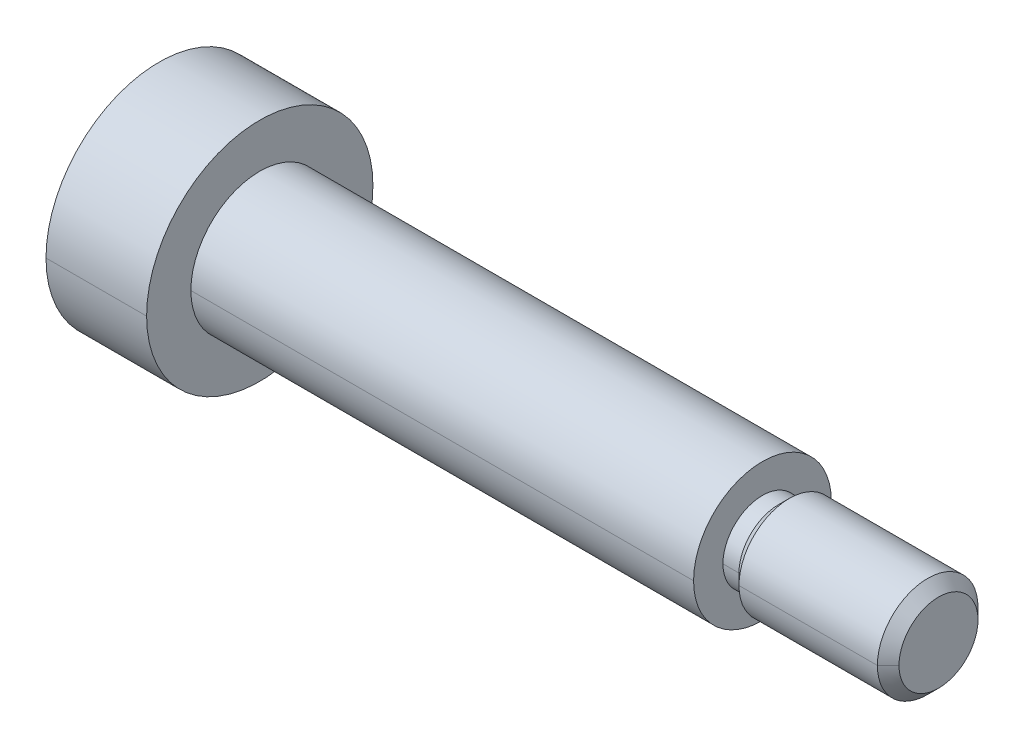
ISO-10303-21;
HEADER;
FILE_DESCRIPTION(('STEP AP214'),'2;1');
FILE_NAME('part.step','',(''),(''),'','','');
FILE_SCHEMA(('AUTOMOTIVE_DESIGN { 1 0 10303 214 1 1 1 1 }'));
ENDSEC;
DATA;
#1=APPLICATION_CONTEXT('core data for automotive mechanical design processes');
#2=APPLICATION_PROTOCOL_DEFINITION('international standard','automotive_design',2000,#1);
#3=PRODUCT_CONTEXT('',#1,'mechanical');
#4=PRODUCT('Part','Part','',(#3));
#5=PRODUCT_RELATED_PRODUCT_CATEGORY('part','',(#4));
#6=PRODUCT_DEFINITION_FORMATION('','',#4);
#7=PRODUCT_DEFINITION_CONTEXT('part definition',#1,'design');
#8=PRODUCT_DEFINITION('design','',#6,#7);
#9=PRODUCT_DEFINITION_SHAPE('','',#8);
#10=(LENGTH_UNIT() NAMED_UNIT(*) SI_UNIT(.MILLI.,.METRE.));
#11=(NAMED_UNIT(*) PLANE_ANGLE_UNIT() SI_UNIT($,.RADIAN.));
#12=(NAMED_UNIT(*) SI_UNIT($,.STERADIAN.) SOLID_ANGLE_UNIT());
#13=UNCERTAINTY_MEASURE_WITH_UNIT(LENGTH_MEASURE(1.E-05),#10,'distance_accuracy_value','');
#14=(GEOMETRIC_REPRESENTATION_CONTEXT(3) GLOBAL_UNCERTAINTY_ASSIGNED_CONTEXT((#13)) GLOBAL_UNIT_ASSIGNED_CONTEXT((#10,
#11,#12)) REPRESENTATION_CONTEXT('',''));
#15=CARTESIAN_POINT('',(0.,0.,0.));
#16=DIRECTION('',(0.,0.,1.));
#17=DIRECTION('',(1.,0.,0.));
#18=AXIS2_PLACEMENT_3D('',#15,#16,#17);
#19=CARTESIAN_POINT('',(26.99,0.,0.));
#20=DIRECTION('',(-1.,0.,0.));
#21=DIRECTION('',(0.,-1.,0.));
#22=AXIS2_PLACEMENT_3D('',#19,#20,#21);
#23=CYLINDRICAL_SURFACE('',#22,4.4996);
#24=CARTESIAN_POINT('',(0.,0.,0.));
#25=DIRECTION('',(1.,0.,0.));
#26=DIRECTION('',(0.,0.,-1.));
#27=AXIS2_PLACEMENT_3D('',#24,#25,#26);
#28=CIRCLE('',#27,4.4996);
#29=CARTESIAN_POINT('',(0.,0.,-4.4996));
#30=VERTEX_POINT('',#29);
#31=CARTESIAN_POINT('',(0.,0.,4.4996));
#32=VERTEX_POINT('',#31);
#33=EDGE_CURVE('E11',#30,#32,#28,.T.);
#34=ORIENTED_EDGE('',*,*,#33,.F.);
#35=DIRECTION('',(-1.,0.,0.));
#36=VECTOR('',#35,1.);
#37=CARTESIAN_POINT('',(0.,0.,-4.4996));
#38=LINE('',#37,#36);
#39=CARTESIAN_POINT('',(-4.0005,0.,-4.4996));
#40=VERTEX_POINT('',#39);
#41=EDGE_CURVE('E25',#30,#40,#38,.T.);
#42=ORIENTED_EDGE('',*,*,#41,.T.);
#43=CARTESIAN_POINT('',(-4.0005,0.,0.));
#44=DIRECTION('',(1.,0.,0.));
#45=DIRECTION('',(0.,0.,-1.));
#46=AXIS2_PLACEMENT_3D('',#43,#44,#45);
#47=CIRCLE('',#46,4.4996);
#48=CARTESIAN_POINT('',(-4.0005,0.,4.4996));
#49=VERTEX_POINT('',#48);
#50=EDGE_CURVE('E342',#40,#49,#47,.T.);
#51=ORIENTED_EDGE('',*,*,#50,.T.);
#52=DIRECTION('',(-1.,0.,0.));
#53=VECTOR('',#52,1.);
#54=CARTESIAN_POINT('',(0.,0.,4.4996));
#55=LINE('',#54,#53);
#56=EDGE_CURVE('E337',#32,#49,#55,.T.);
#57=ORIENTED_EDGE('',*,*,#56,.F.);
#58=EDGE_LOOP('',(#34,#42,#51,#57));
#59=FACE_BOUND('',#58,.T.);
#60=ADVANCED_FACE('F17',(#59),#23,.T.);
#61=CARTESIAN_POINT('',(26.99,0.,0.));
#62=DIRECTION('',(-1.,0.,0.));
#63=DIRECTION('',(0.,1.,0.));
#64=AXIS2_PLACEMENT_3D('',#61,#62,#63);
#65=CYLINDRICAL_SURFACE('',#64,4.4996);
#66=CARTESIAN_POINT('',(-4.0005,0.,0.));
#67=DIRECTION('',(1.,0.,0.));
#68=DIRECTION('',(0.,0.,-1.));
#69=AXIS2_PLACEMENT_3D('',#66,#67,#68);
#70=CIRCLE('',#69,4.4996);
#71=EDGE_CURVE('E333',#49,#40,#70,.T.);
#72=ORIENTED_EDGE('',*,*,#71,.T.);
#73=ORIENTED_EDGE('',*,*,#41,.F.);
#74=CARTESIAN_POINT('',(0.,0.,0.));
#75=DIRECTION('',(1.,0.,0.));
#76=DIRECTION('',(0.,0.,-1.));
#77=AXIS2_PLACEMENT_3D('',#74,#75,#76);
#78=CIRCLE('',#77,4.4996);
#79=EDGE_CURVE('E328',#32,#30,#78,.T.);
#80=ORIENTED_EDGE('',*,*,#79,.F.);
#81=ORIENTED_EDGE('',*,*,#56,.T.);
#82=EDGE_LOOP('',(#72,#73,#80,#81));
#83=FACE_BOUND('',#82,.T.);
#84=ADVANCED_FACE('F355',(#83),#65,.T.);
#85=CARTESIAN_POINT('',(0.,4.4996,0.));
#86=DIRECTION('',(-1.,0.,0.));
#87=DIRECTION('',(0.,0.,1.));
#88=AXIS2_PLACEMENT_3D('',#85,#86,#87);
#89=PLANE('',#88);
#90=CARTESIAN_POINT('',(0.,0.,0.));
#91=DIRECTION('',(1.,0.,0.));
#92=DIRECTION('',(0.,0.,-1.));
#93=AXIS2_PLACEMENT_3D('',#90,#91,#92);
#94=CIRCLE('',#93,2.7394);
#95=CARTESIAN_POINT('',(0.,0.,-2.7394));
#96=VERTEX_POINT('',#95);
#97=CARTESIAN_POINT('',(0.,0.,2.7394));
#98=VERTEX_POINT('',#97);
#99=EDGE_CURVE('E323',#96,#98,#94,.T.);
#100=ORIENTED_EDGE('',*,*,#99,.F.);
#101=CARTESIAN_POINT('',(0.,0.,0.));
#102=DIRECTION('',(1.,0.,0.));
#103=DIRECTION('',(0.,0.,-1.));
#104=AXIS2_PLACEMENT_3D('',#101,#102,#103);
#105=CIRCLE('',#104,2.7394);
#106=EDGE_CURVE('E318',#98,#96,#105,.T.);
#107=ORIENTED_EDGE('',*,*,#106,.F.);
#108=EDGE_LOOP('',(#100,#107));
#109=FACE_BOUND('',#108,.T.);
#110=ORIENTED_EDGE('',*,*,#33,.T.);
#111=ORIENTED_EDGE('',*,*,#79,.T.);
#112=EDGE_LOOP('',(#110,#111));
#113=FACE_BOUND('',#112,.T.);
#114=ADVANCED_FACE('F388',(#109,#113),#89,.F.);
#115=CARTESIAN_POINT('',(26.99,0.,0.));
#116=DIRECTION('',(-1.,0.,0.));
#117=DIRECTION('',(0.,1.,0.));
#118=AXIS2_PLACEMENT_3D('',#115,#116,#117);
#119=CYLINDRICAL_SURFACE('',#118,2.7394);
#120=ORIENTED_EDGE('',*,*,#106,.T.);
#121=DIRECTION('',(-1.,0.,0.));
#122=VECTOR('',#121,1.);
#123=CARTESIAN_POINT('',(19.9898,0.,-2.7394));
#124=LINE('',#123,#122);
#125=CARTESIAN_POINT('',(19.9898,0.,-2.7394));
#126=VERTEX_POINT('',#125);
#127=EDGE_CURVE('E313',#126,#96,#124,.T.);
#128=ORIENTED_EDGE('',*,*,#127,.F.);
#129=CARTESIAN_POINT('',(19.9898,0.,0.));
#130=DIRECTION('',(1.,0.,0.));
#131=DIRECTION('',(0.,0.,-1.));
#132=AXIS2_PLACEMENT_3D('',#129,#130,#131);
#133=CIRCLE('',#132,2.7394);
#134=CARTESIAN_POINT('',(19.9898,0.,2.7394));
#135=VERTEX_POINT('',#134);
#136=EDGE_CURVE('E308',#135,#126,#133,.T.);
#137=ORIENTED_EDGE('',*,*,#136,.F.);
#138=DIRECTION('',(-1.,0.,0.));
#139=VECTOR('',#138,1.);
#140=CARTESIAN_POINT('',(19.9898,0.,2.7394));
#141=LINE('',#140,#139);
#142=EDGE_CURVE('E303',#135,#98,#141,.T.);
#143=ORIENTED_EDGE('',*,*,#142,.T.);
#144=EDGE_LOOP('',(#120,#128,#137,#143));
#145=FACE_BOUND('',#144,.T.);
#146=ADVANCED_FACE('F392',(#145),#119,.T.);
#147=CARTESIAN_POINT('',(26.99,0.,0.));
#148=DIRECTION('',(-1.,0.,0.));
#149=DIRECTION('',(0.,-1.,0.));
#150=AXIS2_PLACEMENT_3D('',#147,#148,#149);
#151=CYLINDRICAL_SURFACE('',#150,2.7394);
#152=CARTESIAN_POINT('',(19.9898,0.,0.));
#153=DIRECTION('',(1.,0.,0.));
#154=DIRECTION('',(0.,0.,-1.));
#155=AXIS2_PLACEMENT_3D('',#152,#153,#154);
#156=CIRCLE('',#155,2.7394);
#157=EDGE_CURVE('E298',#126,#135,#156,.T.);
#158=ORIENTED_EDGE('',*,*,#157,.F.);
#159=ORIENTED_EDGE('',*,*,#127,.T.);
#160=ORIENTED_EDGE('',*,*,#99,.T.);
#161=ORIENTED_EDGE('',*,*,#142,.F.);
#162=EDGE_LOOP('',(#158,#159,#160,#161));
#163=FACE_BOUND('',#162,.T.);
#164=ADVANCED_FACE('F398',(#163),#151,.T.);
#165=CARTESIAN_POINT('',(19.9898,2.7394,0.));
#166=DIRECTION('',(-1.,0.,0.));
#167=DIRECTION('',(0.,0.,1.));
#168=AXIS2_PLACEMENT_3D('',#165,#166,#167);
#169=PLANE('',#168);
#170=CARTESIAN_POINT('',(19.9898,0.,0.));
#171=DIRECTION('',(1.,0.,0.));
#172=DIRECTION('',(0.,0.,-1.));
#173=AXIS2_PLACEMENT_3D('',#170,#171,#172);
#174=CIRCLE('',#173,1.571);
#175=CARTESIAN_POINT('',(19.9898,0.,-1.571));
#176=VERTEX_POINT('',#175);
#177=CARTESIAN_POINT('',(19.9898,0.,1.571));
#178=VERTEX_POINT('',#177);
#179=EDGE_CURVE('E293',#176,#178,#174,.T.);
#180=ORIENTED_EDGE('',*,*,#179,.F.);
#181=CARTESIAN_POINT('',(19.9898,0.,0.));
#182=DIRECTION('',(1.,0.,0.));
#183=DIRECTION('',(0.,0.,-1.));
#184=AXIS2_PLACEMENT_3D('',#181,#182,#183);
#185=CIRCLE('',#184,1.571);
#186=EDGE_CURVE('E288',#178,#176,#185,.T.);
#187=ORIENTED_EDGE('',*,*,#186,.F.);
#188=EDGE_LOOP('',(#180,#187));
#189=FACE_BOUND('',#188,.T.);
#190=ORIENTED_EDGE('',*,*,#157,.T.);
#191=ORIENTED_EDGE('',*,*,#136,.T.);
#192=EDGE_LOOP('',(#190,#191));
#193=FACE_BOUND('',#192,.T.);
#194=ADVANCED_FACE('F402',(#189,#193),#169,.F.);
#195=CARTESIAN_POINT('',(26.99,0.,0.));
#196=DIRECTION('',(-1.,0.,0.));
#197=DIRECTION('',(0.,1.,0.));
#198=AXIS2_PLACEMENT_3D('',#195,#196,#197);
#199=CYLINDRICAL_SURFACE('',#198,1.571);
#200=ORIENTED_EDGE('',*,*,#186,.T.);
#201=DIRECTION('',(-1.,0.,0.));
#202=VECTOR('',#201,1.);
#203=CARTESIAN_POINT('',(20.626681811818,0.,-1.571));
#204=LINE('',#203,#202);
#205=CARTESIAN_POINT('',(20.626681811818,0.,-1.571));
#206=VERTEX_POINT('',#205);
#207=EDGE_CURVE('E283',#206,#176,#204,.T.);
#208=ORIENTED_EDGE('',*,*,#207,.F.);
#209=CARTESIAN_POINT('',(20.626681811818,0.,0.));
#210=DIRECTION('',(1.,0.,0.));
#211=DIRECTION('',(0.,0.,-1.));
#212=AXIS2_PLACEMENT_3D('',#209,#210,#211);
#213=CIRCLE('',#212,1.571);
#214=CARTESIAN_POINT('',(20.626681811818,0.,1.571));
#215=VERTEX_POINT('',#214);
#216=EDGE_CURVE('E278',#215,#206,#213,.T.);
#217=ORIENTED_EDGE('',*,*,#216,.F.);
#218=DIRECTION('',(-1.,0.,0.));
#219=VECTOR('',#218,1.);
#220=CARTESIAN_POINT('',(20.626681811818,0.,1.571));
#221=LINE('',#220,#219);
#222=EDGE_CURVE('E273',#215,#178,#221,.T.);
#223=ORIENTED_EDGE('',*,*,#222,.T.);
#224=EDGE_LOOP('',(#200,#208,#217,#223));
#225=FACE_BOUND('',#224,.T.);
#226=ADVANCED_FACE('F406',(#225),#199,.T.);
#227=CARTESIAN_POINT('',(26.99,0.,0.));
#228=DIRECTION('',(-1.,0.,0.));
#229=DIRECTION('',(0.,-1.,0.));
#230=AXIS2_PLACEMENT_3D('',#227,#228,#229);
#231=CYLINDRICAL_SURFACE('',#230,1.571);
#232=CARTESIAN_POINT('',(20.626681811818,0.,0.));
#233=DIRECTION('',(1.,0.,0.));
#234=DIRECTION('',(0.,0.,-1.));
#235=AXIS2_PLACEMENT_3D('',#232,#233,#234);
#236=CIRCLE('',#235,1.571);
#237=EDGE_CURVE('E268',#206,#215,#236,.T.);
#238=ORIENTED_EDGE('',*,*,#237,.F.);
#239=ORIENTED_EDGE('',*,*,#207,.T.);
#240=ORIENTED_EDGE('',*,*,#179,.T.);
#241=ORIENTED_EDGE('',*,*,#222,.F.);
#242=EDGE_LOOP('',(#238,#239,#240,#241));
#243=FACE_BOUND('',#242,.T.);
#244=ADVANCED_FACE('F410',(#243),#231,.T.);
#245=CARTESIAN_POINT('',(20.626681811818,0.,0.));
#246=DIRECTION('',(1.,0.,0.));
#247=DIRECTION('',(0.,-1.,0.));
#248=AXIS2_PLACEMENT_3D('',#245,#246,#247);
#249=CONICAL_SURFACE('',#248,1.571,0.7853981634);
#250=CARTESIAN_POINT('',(21.055931811818,0.,0.));
#251=DIRECTION('',(1.,0.,0.));
#252=DIRECTION('',(0.,0.,-1.));
#253=AXIS2_PLACEMENT_3D('',#250,#251,#252);
#254=CIRCLE('',#253,2.00025);
#255=CARTESIAN_POINT('',(21.055931811818,0.,-2.00025));
#256=VERTEX_POINT('',#255);
#257=CARTESIAN_POINT('',(21.055931811818,0.,2.00025));
#258=VERTEX_POINT('',#257);
#259=EDGE_CURVE('E263',#256,#258,#254,.T.);
#260=ORIENTED_EDGE('',*,*,#259,.F.);
#261=DIRECTION('',(0.707106781184747,0.,-0.707106781188348));
#262=VECTOR('',#261,1.);
#263=CARTESIAN_POINT('',(20.626681811818,0.,-1.571));
#264=LINE('',#263,#262);
#265=EDGE_CURVE('E258',#206,#256,#264,.T.);
#266=ORIENTED_EDGE('',*,*,#265,.F.);
#267=ORIENTED_EDGE('',*,*,#237,.T.);
#268=DIRECTION('',(0.707106781184747,0.,0.707106781188348));
#269=VECTOR('',#268,1.);
#270=CARTESIAN_POINT('',(20.626681811818,0.,1.571));
#271=LINE('',#270,#269);
#272=EDGE_CURVE('E254',#215,#258,#271,.T.);
#273=ORIENTED_EDGE('',*,*,#272,.T.);
#274=EDGE_LOOP('',(#260,#266,#267,#273));
#275=FACE_BOUND('',#274,.T.);
#276=ADVANCED_FACE('F414',(#275),#249,.T.);
#277=CARTESIAN_POINT('',(20.626681811818,0.,0.));
#278=DIRECTION('',(1.,0.,0.));
#279=DIRECTION('',(0.,1.,0.));
#280=AXIS2_PLACEMENT_3D('',#277,#278,#279);
#281=CONICAL_SURFACE('',#280,1.571,0.7853981634);
#282=ORIENTED_EDGE('',*,*,#216,.T.);
#283=ORIENTED_EDGE('',*,*,#265,.T.);
#284=CARTESIAN_POINT('',(21.055931811818,0.,0.));
#285=DIRECTION('',(1.,0.,0.));
#286=DIRECTION('',(0.,0.,-1.));
#287=AXIS2_PLACEMENT_3D('',#284,#285,#286);
#288=CIRCLE('',#287,2.00025);
#289=EDGE_CURVE('E249',#258,#256,#288,.T.);
#290=ORIENTED_EDGE('',*,*,#289,.F.);
#291=ORIENTED_EDGE('',*,*,#272,.F.);
#292=EDGE_LOOP('',(#282,#283,#290,#291));
#293=FACE_BOUND('',#292,.T.);
#294=ADVANCED_FACE('F418',(#293),#281,.T.);
#295=CARTESIAN_POINT('',(26.99,0.,0.));
#296=DIRECTION('',(-1.,0.,0.));
#297=DIRECTION('',(0.,1.,0.));
#298=AXIS2_PLACEMENT_3D('',#295,#296,#297);
#299=CYLINDRICAL_SURFACE('',#298,2.00025);
#300=ORIENTED_EDGE('',*,*,#289,.T.);
#301=DIRECTION('',(-1.,0.,0.));
#302=VECTOR('',#301,1.);
#303=CARTESIAN_POINT('',(26.56025,0.,-2.00025));
#304=LINE('',#303,#302);
#305=CARTESIAN_POINT('',(26.56025,0.,-2.00025));
#306=VERTEX_POINT('',#305);
#307=EDGE_CURVE('E244',#306,#256,#304,.T.);
#308=ORIENTED_EDGE('',*,*,#307,.F.);
#309=CARTESIAN_POINT('',(26.56025,0.,0.));
#310=DIRECTION('',(1.,0.,0.));
#311=DIRECTION('',(0.,0.,-1.));
#312=AXIS2_PLACEMENT_3D('',#309,#310,#311);
#313=CIRCLE('',#312,2.00025);
#314=CARTESIAN_POINT('',(26.56025,0.,2.00025));
#315=VERTEX_POINT('',#314);
#316=EDGE_CURVE('E239',#315,#306,#313,.T.);
#317=ORIENTED_EDGE('',*,*,#316,.F.);
#318=DIRECTION('',(-1.,0.,0.));
#319=VECTOR('',#318,1.);
#320=CARTESIAN_POINT('',(26.56025,0.,2.00025));
#321=LINE('',#320,#319);
#322=EDGE_CURVE('E234',#315,#258,#321,.T.);
#323=ORIENTED_EDGE('',*,*,#322,.T.);
#324=EDGE_LOOP('',(#300,#308,#317,#323));
#325=FACE_BOUND('',#324,.T.);
#326=ADVANCED_FACE('F422',(#325),#299,.T.);
#327=CARTESIAN_POINT('',(26.99,0.,0.));
#328=DIRECTION('',(-1.,0.,0.));
#329=DIRECTION('',(0.,-1.,0.));
#330=AXIS2_PLACEMENT_3D('',#327,#328,#329);
#331=CYLINDRICAL_SURFACE('',#330,2.00025);
#332=CARTESIAN_POINT('',(26.56025,0.,0.));
#333=DIRECTION('',(1.,0.,0.));
#334=DIRECTION('',(0.,0.,-1.));
#335=AXIS2_PLACEMENT_3D('',#332,#333,#334);
#336=CIRCLE('',#335,2.00025);
#337=EDGE_CURVE('E229',#306,#315,#336,.T.);
#338=ORIENTED_EDGE('',*,*,#337,.F.);
#339=ORIENTED_EDGE('',*,*,#307,.T.);
#340=ORIENTED_EDGE('',*,*,#259,.T.);
#341=ORIENTED_EDGE('',*,*,#322,.F.);
#342=EDGE_LOOP('',(#338,#339,#340,#341));
#343=FACE_BOUND('',#342,.T.);
#344=ADVANCED_FACE('F426',(#343),#331,.T.);
#345=CARTESIAN_POINT('',(26.56025,0.,0.));
#346=DIRECTION('',(-1.,0.,0.));
#347=DIRECTION('',(0.,-1.,0.));
#348=AXIS2_PLACEMENT_3D('',#345,#346,#347);
#349=CONICAL_SURFACE('',#348,2.00025,0.7853981634);
#350=CARTESIAN_POINT('',(26.99,0.,0.));
#351=DIRECTION('',(1.,0.,0.));
#352=DIRECTION('',(0.,0.,-1.));
#353=AXIS2_PLACEMENT_3D('',#350,#351,#352);
#354=CIRCLE('',#353,1.5705);
#355=CARTESIAN_POINT('',(26.99,0.,-1.5705));
#356=VERTEX_POINT('',#355);
#357=CARTESIAN_POINT('',(26.9899999999989,0.,1.5704999999989));
#358=VERTEX_POINT('',#357);
#359=EDGE_CURVE('E224',#356,#358,#354,.T.);
#360=ORIENTED_EDGE('',*,*,#359,.F.);
#361=DIRECTION('',(-0.707106781184745,0.,-0.707106781188351));
#362=VECTOR('',#361,1.);
#363=CARTESIAN_POINT('',(26.9899999999989,0.,-1.5704999999989));
#364=LINE('',#363,#362);
#365=EDGE_CURVE('E219',#356,#306,#364,.T.);
#366=ORIENTED_EDGE('',*,*,#365,.T.);
#367=ORIENTED_EDGE('',*,*,#337,.T.);
#368=DIRECTION('',(-0.707106781184745,0.,0.707106781188351));
#369=VECTOR('',#368,1.);
#370=CARTESIAN_POINT('',(26.9899999999989,0.,1.5704999999989));
#371=LINE('',#370,#369);
#372=EDGE_CURVE('E214',#358,#315,#371,.T.);
#373=ORIENTED_EDGE('',*,*,#372,.F.);
#374=EDGE_LOOP('',(#360,#366,#367,#373));
#375=FACE_BOUND('',#374,.T.);
#376=ADVANCED_FACE('F430',(#375),#349,.T.);
#377=CARTESIAN_POINT('',(26.56025,0.,0.));
#378=DIRECTION('',(-1.,0.,0.));
#379=DIRECTION('',(0.,1.,0.));
#380=AXIS2_PLACEMENT_3D('',#377,#378,#379);
#381=CONICAL_SURFACE('',#380,2.00025,0.7853981634);
#382=ORIENTED_EDGE('',*,*,#316,.T.);
#383=ORIENTED_EDGE('',*,*,#365,.F.);
#384=CARTESIAN_POINT('',(26.99,0.,0.));
#385=DIRECTION('',(1.,0.,0.));
#386=DIRECTION('',(0.,0.,-1.));
#387=AXIS2_PLACEMENT_3D('',#384,#385,#386);
#388=CIRCLE('',#387,1.5705);
#389=EDGE_CURVE('E209',#358,#356,#388,.T.);
#390=ORIENTED_EDGE('',*,*,#389,.F.);
#391=ORIENTED_EDGE('',*,*,#372,.T.);
#392=EDGE_LOOP('',(#382,#383,#390,#391));
#393=FACE_BOUND('',#392,.T.);
#394=ADVANCED_FACE('F434',(#393),#381,.T.);
#395=CARTESIAN_POINT('',(26.99,1.5705,0.));
#396=DIRECTION('',(-1.,0.,0.));
#397=DIRECTION('',(0.,0.,1.));
#398=AXIS2_PLACEMENT_3D('',#395,#396,#397);
#399=PLANE('',#398);
#400=ORIENTED_EDGE('',*,*,#359,.T.);
#401=ORIENTED_EDGE('',*,*,#389,.T.);
#402=EDGE_LOOP('',(#400,#401));
#403=FACE_BOUND('',#402,.T.);
#404=ADVANCED_FACE('F360',(#403),#399,.F.);
#405=CARTESIAN_POINT('',(-4.0005,0.,0.));
#406=DIRECTION('',(1.,0.,0.));
#407=DIRECTION('',(0.,0.,-1.));
#408=AXIS2_PLACEMENT_3D('',#405,#406,#407);
#409=PLANE('',#408);
#410=ORIENTED_EDGE('',*,*,#50,.F.);
#411=ORIENTED_EDGE('',*,*,#71,.F.);
#412=EDGE_LOOP('',(#410,#411));
#413=FACE_BOUND('',#412,.T.);
#414=DIRECTION('',(0.,-1.,0.));
#415=VECTOR('',#414,1.);
#416=CARTESIAN_POINT('',(-4.0005,0.86593880124406,1.49985));
#417=LINE('',#416,#415);
#418=CARTESIAN_POINT('',(-4.0005,0.86593880124406,1.49985));
#419=VERTEX_POINT('',#418);
#420=CARTESIAN_POINT('',(-4.0005,-0.86593880124406,1.49985));
#421=VERTEX_POINT('',#420);
#422=EDGE_CURVE('E205',#419,#421,#417,.T.);
#423=ORIENTED_EDGE('',*,*,#422,.T.);
#424=DIRECTION('',(0.,-0.499999999999991,-0.866025403784444));
#425=VECTOR('',#424,1.);
#426=CARTESIAN_POINT('',(-4.0005,-0.86593880124406,1.49985));
#427=LINE('',#426,#425);
#428=CARTESIAN_POINT('',(-4.0005,-1.7318776024881,0.));
#429=VERTEX_POINT('',#428);
#430=EDGE_CURVE('E201',#421,#429,#427,.T.);
#431=ORIENTED_EDGE('',*,*,#430,.T.);
#432=DIRECTION('',(0.,0.499999999999991,-0.866025403784444));
#433=VECTOR('',#432,1.);
#434=CARTESIAN_POINT('',(-4.0005,-1.7318776024881,0.));
#435=LINE('',#434,#433);
#436=CARTESIAN_POINT('',(-4.0005,-0.86593880124406,-1.49985));
#437=VERTEX_POINT('',#436);
#438=EDGE_CURVE('E197',#429,#437,#435,.T.);
#439=ORIENTED_EDGE('',*,*,#438,.T.);
#440=DIRECTION('',(0.,1.,0.));
#441=VECTOR('',#440,1.);
#442=CARTESIAN_POINT('',(-4.0005,-0.86593880124406,-1.49985));
#443=LINE('',#442,#441);
#444=CARTESIAN_POINT('',(-4.0005,0.86593880124406,-1.49985));
#445=VERTEX_POINT('',#444);
#446=EDGE_CURVE('E193',#437,#445,#443,.T.);
#447=ORIENTED_EDGE('',*,*,#446,.T.);
#448=DIRECTION('',(0.,0.499999999999991,0.866025403784444));
#449=VECTOR('',#448,1.);
#450=CARTESIAN_POINT('',(-4.0005,0.86593880124406,-1.49985));
#451=LINE('',#450,#449);
#452=CARTESIAN_POINT('',(-4.0005,1.7318776024881,0.));
#453=VERTEX_POINT('',#452);
#454=EDGE_CURVE('E138',#445,#453,#451,.T.);
#455=ORIENTED_EDGE('',*,*,#454,.T.);
#456=DIRECTION('',(0.,-0.499999999999991,0.866025403784444));
#457=VECTOR('',#456,1.);
#458=CARTESIAN_POINT('',(-4.0005,1.7318776024881,0.));
#459=LINE('',#458,#457);
#460=EDGE_CURVE('E186',#453,#419,#459,.T.);
#461=ORIENTED_EDGE('',*,*,#460,.T.);
#462=EDGE_LOOP('',(#423,#431,#439,#447,#455,#461));
#463=FACE_BOUND('',#462,.T.);
#464=ADVANCED_FACE('F356',(#413,#463),#409,.F.);
#465=CARTESIAN_POINT('',(-1.8009,1.7318776024881,0.));
#466=DIRECTION('',(0.,-0.866025403784444,-0.499999999999991));
#467=DIRECTION('',(0.,0.499999999999991,-0.866025403784444));
#468=AXIS2_PLACEMENT_3D('',#465,#466,#467);
#469=PLANE('',#468);
#470=ORIENTED_EDGE('',*,*,#460,.F.);
#471=DIRECTION('',(-1.,0.,0.));
#472=VECTOR('',#471,1.);
#473=CARTESIAN_POINT('',(-1.8009,1.7318776024881,0.));
#474=LINE('',#473,#472);
#475=CARTESIAN_POINT('',(-1.8009,1.7318776024881,0.));
#476=VERTEX_POINT('',#475);
#477=EDGE_CURVE('E182',#476,#453,#474,.T.);
#478=ORIENTED_EDGE('',*,*,#477,.F.);
#479=DIRECTION('',(0.,-0.499999999999991,0.866025403784444));
#480=VECTOR('',#479,1.);
#481=CARTESIAN_POINT('',(-1.8009,1.7318776024881,0.));
#482=LINE('',#481,#480);
#483=CARTESIAN_POINT('',(-1.8009,0.86593880124406,1.49985));
#484=VERTEX_POINT('',#483);
#485=EDGE_CURVE('E142',#476,#484,#482,.T.);
#486=ORIENTED_EDGE('',*,*,#485,.T.);
#487=DIRECTION('',(-1.,0.,0.));
#488=VECTOR('',#487,1.);
#489=CARTESIAN_POINT('',(-1.8009,0.86593880124406,1.49985));
#490=LINE('',#489,#488);
#491=EDGE_CURVE('E174',#484,#419,#490,.T.);
#492=ORIENTED_EDGE('',*,*,#491,.T.);
#493=EDGE_LOOP('',(#470,#478,#486,#492));
#494=FACE_BOUND('',#493,.T.);
#495=ADVANCED_FACE('F359',(#494),#469,.T.);
#496=CARTESIAN_POINT('',(-1.8009,0.86593880124406,1.49985));
#497=DIRECTION('',(0.,0.,-1.));
#498=DIRECTION('',(-1.,0.,0.));
#499=AXIS2_PLACEMENT_3D('',#496,#497,#498);
#500=PLANE('',#499);
#501=ORIENTED_EDGE('',*,*,#422,.F.);
#502=ORIENTED_EDGE('',*,*,#491,.F.);
#503=DIRECTION('',(0.,-1.,0.));
#504=VECTOR('',#503,1.);
#505=CARTESIAN_POINT('',(-1.8009,0.86593880124406,1.49985));
#506=LINE('',#505,#504);
#507=CARTESIAN_POINT('',(-1.8009,-0.86593880124406,1.49985));
#508=VERTEX_POINT('',#507);
#509=EDGE_CURVE('E170',#484,#508,#506,.T.);
#510=ORIENTED_EDGE('',*,*,#509,.T.);
#511=DIRECTION('',(-1.,0.,0.));
#512=VECTOR('',#511,1.);
#513=CARTESIAN_POINT('',(-1.8009,-0.86593880124406,1.49985));
#514=LINE('',#513,#512);
#515=EDGE_CURVE('E165',#508,#421,#514,.T.);
#516=ORIENTED_EDGE('',*,*,#515,.T.);
#517=EDGE_LOOP('',(#501,#502,#510,#516));
#518=FACE_BOUND('',#517,.T.);
#519=ADVANCED_FACE('F368',(#518),#500,.T.);
#520=CARTESIAN_POINT('',(-1.8009,-0.86593880124406,1.49985));
#521=DIRECTION('',(0.,0.866025403784444,-0.499999999999991));
#522=DIRECTION('',(0.,0.499999999999991,0.866025403784444));
#523=AXIS2_PLACEMENT_3D('',#520,#521,#522);
#524=PLANE('',#523);
#525=ORIENTED_EDGE('',*,*,#430,.F.);
#526=ORIENTED_EDGE('',*,*,#515,.F.);
#527=DIRECTION('',(0.,-0.499999999999991,-0.866025403784444));
#528=VECTOR('',#527,1.);
#529=CARTESIAN_POINT('',(-1.8009,-0.86593880124406,1.49985));
#530=LINE('',#529,#528);
#531=CARTESIAN_POINT('',(-1.8009,-1.7318776024881,0.));
#532=VERTEX_POINT('',#531);
#533=EDGE_CURVE('E161',#508,#532,#530,.T.);
#534=ORIENTED_EDGE('',*,*,#533,.T.);
#535=DIRECTION('',(-1.,0.,0.));
#536=VECTOR('',#535,1.);
#537=CARTESIAN_POINT('',(-1.8009,-1.7318776024881,0.));
#538=LINE('',#537,#536);
#539=EDGE_CURVE('E156',#532,#429,#538,.T.);
#540=ORIENTED_EDGE('',*,*,#539,.T.);
#541=EDGE_LOOP('',(#525,#526,#534,#540));
#542=FACE_BOUND('',#541,.T.);
#543=ADVANCED_FACE('F371',(#542),#524,.T.);
#544=CARTESIAN_POINT('',(-1.8009,-1.7318776024881,0.));
#545=DIRECTION('',(0.,0.866025403784444,0.499999999999991));
#546=DIRECTION('',(0.,-0.499999999999991,0.866025403784444));
#547=AXIS2_PLACEMENT_3D('',#544,#545,#546);
#548=PLANE('',#547);
#549=ORIENTED_EDGE('',*,*,#438,.F.);
#550=ORIENTED_EDGE('',*,*,#539,.F.);
#551=DIRECTION('',(0.,0.499999999999991,-0.866025403784444));
#552=VECTOR('',#551,1.);
#553=CARTESIAN_POINT('',(-1.8009,-1.7318776024881,0.));
#554=LINE('',#553,#552);
#555=CARTESIAN_POINT('',(-1.8009,-0.86593880124406,-1.49985));
#556=VERTEX_POINT('',#555);
#557=EDGE_CURVE('E152',#532,#556,#554,.T.);
#558=ORIENTED_EDGE('',*,*,#557,.T.);
#559=DIRECTION('',(-1.,0.,0.));
#560=VECTOR('',#559,1.);
#561=CARTESIAN_POINT('',(-1.8009,-0.86593880124406,-1.49985));
#562=LINE('',#561,#560);
#563=EDGE_CURVE('E127',#556,#437,#562,.T.);
#564=ORIENTED_EDGE('',*,*,#563,.T.);
#565=EDGE_LOOP('',(#549,#550,#558,#564));
#566=FACE_BOUND('',#565,.T.);
#567=ADVANCED_FACE('F375',(#566),#548,.T.);
#568=CARTESIAN_POINT('',(-1.8009,-0.86593880124406,-1.49985));
#569=DIRECTION('',(0.,0.,1.));
#570=DIRECTION('',(1.,0.,0.));
#571=AXIS2_PLACEMENT_3D('',#568,#569,#570);
#572=PLANE('',#571);
#573=ORIENTED_EDGE('',*,*,#446,.F.);
#574=ORIENTED_EDGE('',*,*,#563,.F.);
#575=DIRECTION('',(0.,1.,0.));
#576=VECTOR('',#575,1.);
#577=CARTESIAN_POINT('',(-1.8009,-0.86593880124406,-1.49985));
#578=LINE('',#577,#576);
#579=CARTESIAN_POINT('',(-1.8009,0.86593880124406,-1.49985));
#580=VERTEX_POINT('',#579);
#581=EDGE_CURVE('E120',#556,#580,#578,.T.);
#582=ORIENTED_EDGE('',*,*,#581,.T.);
#583=DIRECTION('',(-1.,0.,0.));
#584=VECTOR('',#583,1.);
#585=CARTESIAN_POINT('',(-1.8009,0.86593880124406,-1.49985));
#586=LINE('',#585,#584);
#587=EDGE_CURVE('E124',#580,#445,#586,.T.);
#588=ORIENTED_EDGE('',*,*,#587,.T.);
#589=EDGE_LOOP('',(#573,#574,#582,#588));
#590=FACE_BOUND('',#589,.T.);
#591=ADVANCED_FACE('F123',(#590),#572,.T.);
#592=CARTESIAN_POINT('',(-1.8009,0.86593880124406,-1.49985));
#593=DIRECTION('',(0.,-0.866025403784444,0.499999999999991));
#594=DIRECTION('',(0.,-0.499999999999991,-0.866025403784444));
#595=AXIS2_PLACEMENT_3D('',#592,#593,#594);
#596=PLANE('',#595);
#597=ORIENTED_EDGE('',*,*,#454,.F.);
#598=ORIENTED_EDGE('',*,*,#587,.F.);
#599=DIRECTION('',(0.,0.499999999999991,0.866025403784444));
#600=VECTOR('',#599,1.);
#601=CARTESIAN_POINT('',(-1.8009,0.86593880124406,-1.49985));
#602=LINE('',#601,#600);
#603=EDGE_CURVE('E136',#580,#476,#602,.T.);
#604=ORIENTED_EDGE('',*,*,#603,.T.);
#605=ORIENTED_EDGE('',*,*,#477,.T.);
#606=EDGE_LOOP('',(#597,#598,#604,#605));
#607=FACE_BOUND('',#606,.T.);
#608=ADVANCED_FACE('F134',(#607),#596,.T.);
#609=CARTESIAN_POINT('',(-1.8009,0.,0.));
#610=DIRECTION('',(1.,0.,0.));
#611=DIRECTION('',(0.,0.,-1.));
#612=AXIS2_PLACEMENT_3D('',#609,#610,#611);
#613=PLANE('',#612);
#614=ORIENTED_EDGE('',*,*,#509,.F.);
#615=ORIENTED_EDGE('',*,*,#485,.F.);
#616=ORIENTED_EDGE('',*,*,#603,.F.);
#617=ORIENTED_EDGE('',*,*,#581,.F.);
#618=ORIENTED_EDGE('',*,*,#557,.F.);
#619=ORIENTED_EDGE('',*,*,#533,.F.);
#620=EDGE_LOOP('',(#614,#615,#616,#617,#618,#619));
#621=FACE_BOUND('',#620,.T.);
#622=ADVANCED_FACE('F141',(#621),#613,.F.);
#623=CLOSED_SHELL('',(#60,#84,#114,#146,#164,#194,#226,#244,#276,#294,#326,#344,#376,#394,#404,
#464,#495,#519,#543,#567,#591,#608,#622));
#624=MANIFOLD_SOLID_BREP('B1',#623);
#625=ADVANCED_BREP_SHAPE_REPRESENTATION('',(#18,#624),#14);
#626=SHAPE_DEFINITION_REPRESENTATION(#9,#625);
ENDSEC;
END-ISO-10303-21;
